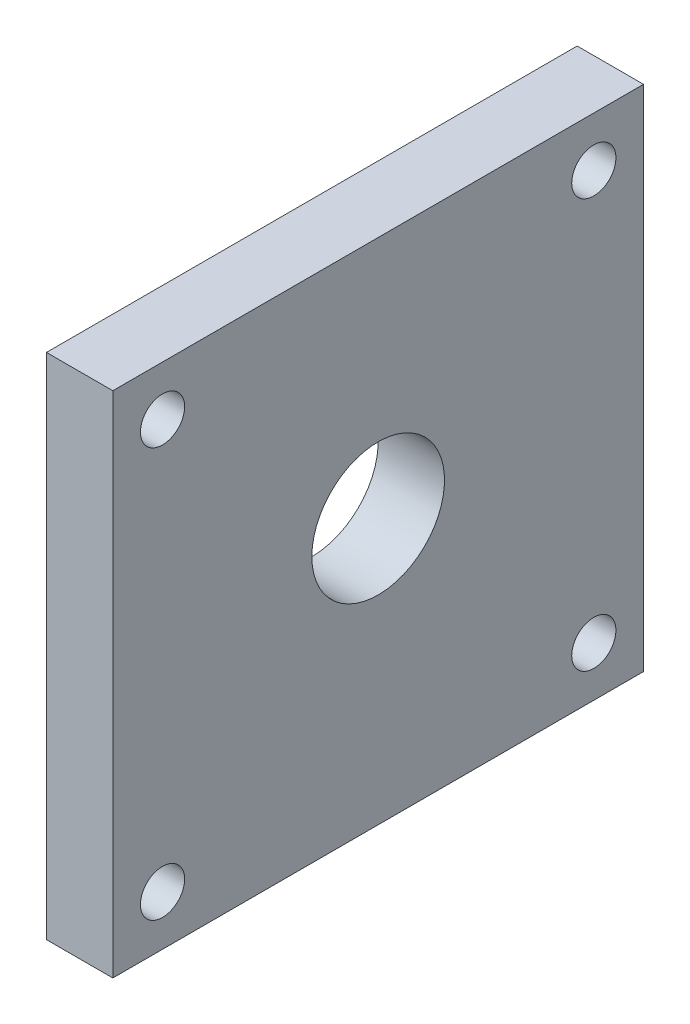
ISO-10303-21;
HEADER;
FILE_DESCRIPTION(('STEP AP214'),'2;1');
FILE_NAME('part.step','',(''),(''),'','','');
FILE_SCHEMA(('AUTOMOTIVE_DESIGN { 1 0 10303 214 1 1 1 1 }'));
ENDSEC;
DATA;
#1=APPLICATION_CONTEXT('core data for automotive mechanical design processes');
#2=APPLICATION_PROTOCOL_DEFINITION('international standard','automotive_design',2000,#1);
#3=PRODUCT_CONTEXT('',#1,'mechanical');
#4=PRODUCT('Part','Part','',(#3));
#5=PRODUCT_RELATED_PRODUCT_CATEGORY('part','',(#4));
#6=PRODUCT_DEFINITION_FORMATION('','',#4);
#7=PRODUCT_DEFINITION_CONTEXT('part definition',#1,'design');
#8=PRODUCT_DEFINITION('design','',#6,#7);
#9=PRODUCT_DEFINITION_SHAPE('','',#8);
#10=(LENGTH_UNIT() NAMED_UNIT(*) SI_UNIT(.MILLI.,.METRE.));
#11=(NAMED_UNIT(*) PLANE_ANGLE_UNIT() SI_UNIT($,.RADIAN.));
#12=(NAMED_UNIT(*) SI_UNIT($,.STERADIAN.) SOLID_ANGLE_UNIT());
#13=UNCERTAINTY_MEASURE_WITH_UNIT(LENGTH_MEASURE(1.E-05),#10,'distance_accuracy_value','');
#14=(GEOMETRIC_REPRESENTATION_CONTEXT(3) GLOBAL_UNCERTAINTY_ASSIGNED_CONTEXT((#13)) GLOBAL_UNIT_ASSIGNED_CONTEXT((#10,
#11,#12)) REPRESENTATION_CONTEXT('',''));
#15=CARTESIAN_POINT('',(0.,0.,0.));
#16=DIRECTION('',(0.,0.,1.));
#17=DIRECTION('',(1.,0.,0.));
#18=AXIS2_PLACEMENT_3D('',#15,#16,#17);
#19=CARTESIAN_POINT('',(9.525,0.,0.));
#20=DIRECTION('',(0.,0.,-1.));
#21=DIRECTION('',(0.,1.,0.));
#22=AXIS2_PLACEMENT_3D('',#19,#20,#21);
#23=PLANE('',#22);
#24=DIRECTION('',(0.,-1.,0.));
#25=VECTOR('',#24,1.);
#26=CARTESIAN_POINT('',(0.,0.,0.));
#27=LINE('',#26,#25);
#28=CARTESIAN_POINT('',(0.,0.,0.));
#29=VERTEX_POINT('',#28);
#30=CARTESIAN_POINT('',(0.,-73.025,0.));
#31=VERTEX_POINT('',#30);
#32=EDGE_CURVE('E76',#29,#31,#27,.T.);
#33=ORIENTED_EDGE('',*,*,#32,.T.);
#34=DIRECTION('',(-1.,0.,0.));
#35=VECTOR('',#34,1.);
#36=CARTESIAN_POINT('',(9.525,-73.025,0.));
#37=LINE('',#36,#35);
#38=CARTESIAN_POINT('',(9.525,-73.025,0.));
#39=VERTEX_POINT('',#38);
#40=EDGE_CURVE('E11',#39,#31,#37,.T.);
#41=ORIENTED_EDGE('',*,*,#40,.F.);
#42=DIRECTION('',(0.,-1.,0.));
#43=VECTOR('',#42,1.);
#44=CARTESIAN_POINT('',(9.525,0.,0.));
#45=LINE('',#44,#43);
#46=CARTESIAN_POINT('',(9.525,0.,0.));
#47=VERTEX_POINT('',#46);
#48=EDGE_CURVE('E99',#47,#39,#45,.T.);
#49=ORIENTED_EDGE('',*,*,#48,.F.);
#50=DIRECTION('',(-1.,0.,0.));
#51=VECTOR('',#50,1.);
#52=CARTESIAN_POINT('',(9.525,0.,0.));
#53=LINE('',#52,#51);
#54=EDGE_CURVE('E88',#47,#29,#53,.T.);
#55=ORIENTED_EDGE('',*,*,#54,.T.);
#56=EDGE_LOOP('',(#33,#41,#49,#55));
#57=FACE_BOUND('',#56,.T.);
#58=ADVANCED_FACE('F32',(#57),#23,.F.);
#59=CARTESIAN_POINT('',(9.525,-73.025,0.));
#60=DIRECTION('',(0.,1.,0.));
#61=DIRECTION('',(0.,0.,1.));
#62=AXIS2_PLACEMENT_3D('',#59,#60,#61);
#63=PLANE('',#62);
#64=DIRECTION('',(0.,0.,-1.));
#65=VECTOR('',#64,1.);
#66=CARTESIAN_POINT('',(0.,-73.025,0.));
#67=LINE('',#66,#65);
#68=CARTESIAN_POINT('',(0.,-73.025,-76.2));
#69=VERTEX_POINT('',#68);
#70=EDGE_CURVE('E72',#31,#69,#67,.T.);
#71=ORIENTED_EDGE('',*,*,#70,.T.);
#72=DIRECTION('',(-1.,0.,0.));
#73=VECTOR('',#72,1.);
#74=CARTESIAN_POINT('',(9.525,-73.025,-76.2));
#75=LINE('',#74,#73);
#76=CARTESIAN_POINT('',(9.525,-73.025,-76.2));
#77=VERTEX_POINT('',#76);
#78=EDGE_CURVE('E39',#77,#69,#75,.T.);
#79=ORIENTED_EDGE('',*,*,#78,.F.);
#80=DIRECTION('',(0.,0.,-1.));
#81=VECTOR('',#80,1.);
#82=CARTESIAN_POINT('',(9.525,-73.025,0.));
#83=LINE('',#82,#81);
#84=EDGE_CURVE('E84',#39,#77,#83,.T.);
#85=ORIENTED_EDGE('',*,*,#84,.F.);
#86=ORIENTED_EDGE('',*,*,#40,.T.);
#87=EDGE_LOOP('',(#71,#79,#85,#86));
#88=FACE_BOUND('',#87,.T.);
#89=ADVANCED_FACE('F83',(#88),#63,.F.);
#90=CARTESIAN_POINT('',(9.525,0.,-76.2));
#91=DIRECTION('',(0.,0.,1.));
#92=DIRECTION('',(0.,-1.,0.));
#93=AXIS2_PLACEMENT_3D('',#90,#91,#92);
#94=PLANE('',#93);
#95=DIRECTION('',(0.,1.,0.));
#96=VECTOR('',#95,1.);
#97=CARTESIAN_POINT('',(0.,0.,-76.2));
#98=LINE('',#97,#96);
#99=CARTESIAN_POINT('',(0.,0.,-76.2));
#100=VERTEX_POINT('',#99);
#101=EDGE_CURVE('E77',#69,#100,#98,.T.);
#102=ORIENTED_EDGE('',*,*,#101,.T.);
#103=DIRECTION('',(-1.,0.,0.));
#104=VECTOR('',#103,1.);
#105=CARTESIAN_POINT('',(9.525,0.,-76.2));
#106=LINE('',#105,#104);
#107=CARTESIAN_POINT('',(9.525,0.,-76.2));
#108=VERTEX_POINT('',#107);
#109=EDGE_CURVE('E105',#108,#100,#106,.T.);
#110=ORIENTED_EDGE('',*,*,#109,.F.);
#111=DIRECTION('',(0.,1.,0.));
#112=VECTOR('',#111,1.);
#113=CARTESIAN_POINT('',(9.525,0.,-76.2));
#114=LINE('',#113,#112);
#115=EDGE_CURVE('E51',#77,#108,#114,.T.);
#116=ORIENTED_EDGE('',*,*,#115,.F.);
#117=ORIENTED_EDGE('',*,*,#78,.T.);
#118=EDGE_LOOP('',(#102,#110,#116,#117));
#119=FACE_BOUND('',#118,.T.);
#120=ADVANCED_FACE('F108',(#119),#94,.F.);
#121=CARTESIAN_POINT('',(9.525,0.,0.));
#122=DIRECTION('',(0.,-1.,0.));
#123=DIRECTION('',(0.,0.,-1.));
#124=AXIS2_PLACEMENT_3D('',#121,#122,#123);
#125=PLANE('',#124);
#126=DIRECTION('',(0.,0.,1.));
#127=VECTOR('',#126,1.);
#128=CARTESIAN_POINT('',(0.,0.,0.));
#129=LINE('',#128,#127);
#130=EDGE_CURVE('E97',#100,#29,#129,.T.);
#131=ORIENTED_EDGE('',*,*,#130,.T.);
#132=ORIENTED_EDGE('',*,*,#54,.F.);
#133=DIRECTION('',(0.,0.,1.));
#134=VECTOR('',#133,1.);
#135=CARTESIAN_POINT('',(9.525,0.,0.));
#136=LINE('',#135,#134);
#137=EDGE_CURVE('E46',#108,#47,#136,.T.);
#138=ORIENTED_EDGE('',*,*,#137,.F.);
#139=ORIENTED_EDGE('',*,*,#109,.T.);
#140=EDGE_LOOP('',(#131,#132,#138,#139));
#141=FACE_BOUND('',#140,.T.);
#142=ADVANCED_FACE('F110',(#141),#125,.F.);
#143=CARTESIAN_POINT('',(9.525,-73.025,0.));
#144=DIRECTION('',(1.,0.,0.));
#145=DIRECTION('',(0.,0.,-1.));
#146=AXIS2_PLACEMENT_3D('',#143,#144,#145);
#147=PLANE('',#146);
#148=CARTESIAN_POINT('',(9.525,-34.925,-38.1));
#149=DIRECTION('',(-1.,0.,0.));
#150=DIRECTION('',(0.,0.,1.));
#151=AXIS2_PLACEMENT_3D('',#148,#149,#150);
#152=CIRCLE('',#151,9.525);
#153=CARTESIAN_POINT('',(9.525,-34.925,-28.575));
#154=VERTEX_POINT('',#153);
#155=EDGE_CURVE('E204',#154,#154,#152,.T.);
#156=ORIENTED_EDGE('',*,*,#155,.T.);
#157=EDGE_LOOP('',(#156));
#158=FACE_BOUND('',#157,.T.);
#159=CARTESIAN_POINT('',(9.525,-65.8876,-7.13740000000006));
#160=DIRECTION('',(-1.,0.,0.));
#161=DIRECTION('',(0.,0.,1.));
#162=AXIS2_PLACEMENT_3D('',#159,#160,#161);
#163=CIRCLE('',#162,3.175);
#164=CARTESIAN_POINT('',(9.525,-65.8876,-3.96240000000006));
#165=VERTEX_POINT('',#164);
#166=EDGE_CURVE('E214',#165,#165,#163,.T.);
#167=ORIENTED_EDGE('',*,*,#166,.T.);
#168=EDGE_LOOP('',(#167));
#169=FACE_BOUND('',#168,.T.);
#170=CARTESIAN_POINT('',(9.525,-65.8876,-69.0626));
#171=DIRECTION('',(-1.,0.,0.));
#172=DIRECTION('',(0.,0.,1.));
#173=AXIS2_PLACEMENT_3D('',#170,#171,#172);
#174=CIRCLE('',#173,3.175);
#175=CARTESIAN_POINT('',(9.525,-65.8876,-65.8876));
#176=VERTEX_POINT('',#175);
#177=EDGE_CURVE('E220',#176,#176,#174,.T.);
#178=ORIENTED_EDGE('',*,*,#177,.T.);
#179=EDGE_LOOP('',(#178));
#180=FACE_BOUND('',#179,.T.);
#181=CARTESIAN_POINT('',(9.525,-7.1374,-69.0626));
#182=DIRECTION('',(-1.,0.,0.));
#183=DIRECTION('',(0.,0.,1.));
#184=AXIS2_PLACEMENT_3D('',#181,#182,#183);
#185=CIRCLE('',#184,3.175);
#186=CARTESIAN_POINT('',(9.525,-7.1374,-65.8876));
#187=VERTEX_POINT('',#186);
#188=EDGE_CURVE('E226',#187,#187,#185,.T.);
#189=ORIENTED_EDGE('',*,*,#188,.T.);
#190=EDGE_LOOP('',(#189));
#191=FACE_BOUND('',#190,.T.);
#192=CARTESIAN_POINT('',(9.525,-7.1374,-7.13740000000003));
#193=DIRECTION('',(-1.,0.,0.));
#194=DIRECTION('',(0.,0.,1.));
#195=AXIS2_PLACEMENT_3D('',#192,#193,#194);
#196=CIRCLE('',#195,3.175);
#197=CARTESIAN_POINT('',(9.525,-7.1374,-3.96240000000003));
#198=VERTEX_POINT('',#197);
#199=EDGE_CURVE('E89',#198,#198,#196,.T.);
#200=ORIENTED_EDGE('',*,*,#199,.T.);
#201=EDGE_LOOP('',(#200));
#202=FACE_BOUND('',#201,.T.);
#203=ORIENTED_EDGE('',*,*,#48,.T.);
#204=ORIENTED_EDGE('',*,*,#84,.T.);
#205=ORIENTED_EDGE('',*,*,#115,.T.);
#206=ORIENTED_EDGE('',*,*,#137,.T.);
#207=EDGE_LOOP('',(#203,#204,#205,#206));
#208=FACE_BOUND('',#207,.T.);
#209=ADVANCED_FACE('F111',(#158,#169,#180,#191,#202,#208),#147,.T.);
#210=CARTESIAN_POINT('',(0.,-73.025,0.));
#211=DIRECTION('',(1.,0.,0.));
#212=DIRECTION('',(0.,0.,-1.));
#213=AXIS2_PLACEMENT_3D('',#210,#211,#212);
#214=PLANE('',#213);
#215=CARTESIAN_POINT('',(0.,-34.925,-38.1));
#216=DIRECTION('',(-1.,0.,0.));
#217=DIRECTION('',(0.,0.,1.));
#218=AXIS2_PLACEMENT_3D('',#215,#216,#217);
#219=CIRCLE('',#218,9.525);
#220=CARTESIAN_POINT('',(0.,-34.925,-28.575));
#221=VERTEX_POINT('',#220);
#222=EDGE_CURVE('E207',#221,#221,#219,.T.);
#223=ORIENTED_EDGE('',*,*,#222,.F.);
#224=EDGE_LOOP('',(#223));
#225=FACE_BOUND('',#224,.T.);
#226=CARTESIAN_POINT('',(0.,-65.8876,-7.13740000000006));
#227=DIRECTION('',(-1.,0.,0.));
#228=DIRECTION('',(0.,0.,1.));
#229=AXIS2_PLACEMENT_3D('',#226,#227,#228);
#230=CIRCLE('',#229,3.175);
#231=CARTESIAN_POINT('',(0.,-65.8876,-3.96240000000006));
#232=VERTEX_POINT('',#231);
#233=EDGE_CURVE('E209',#232,#232,#230,.T.);
#234=ORIENTED_EDGE('',*,*,#233,.F.);
#235=EDGE_LOOP('',(#234));
#236=FACE_BOUND('',#235,.T.);
#237=CARTESIAN_POINT('',(0.,-65.8876,-69.0626));
#238=DIRECTION('',(-1.,0.,0.));
#239=DIRECTION('',(0.,0.,1.));
#240=AXIS2_PLACEMENT_3D('',#237,#238,#239);
#241=CIRCLE('',#240,3.175);
#242=CARTESIAN_POINT('',(0.,-65.8876,-65.8876));
#243=VERTEX_POINT('',#242);
#244=EDGE_CURVE('E217',#243,#243,#241,.T.);
#245=ORIENTED_EDGE('',*,*,#244,.F.);
#246=EDGE_LOOP('',(#245));
#247=FACE_BOUND('',#246,.T.);
#248=CARTESIAN_POINT('',(0.,-7.1374,-69.0626));
#249=DIRECTION('',(-1.,0.,0.));
#250=DIRECTION('',(0.,0.,1.));
#251=AXIS2_PLACEMENT_3D('',#248,#249,#250);
#252=CIRCLE('',#251,3.175);
#253=CARTESIAN_POINT('',(0.,-7.1374,-65.8876));
#254=VERTEX_POINT('',#253);
#255=EDGE_CURVE('E223',#254,#254,#252,.T.);
#256=ORIENTED_EDGE('',*,*,#255,.F.);
#257=EDGE_LOOP('',(#256));
#258=FACE_BOUND('',#257,.T.);
#259=CARTESIAN_POINT('',(0.,-7.1374,-7.13740000000003));
#260=DIRECTION('',(-1.,0.,0.));
#261=DIRECTION('',(0.,0.,1.));
#262=AXIS2_PLACEMENT_3D('',#259,#260,#261);
#263=CIRCLE('',#262,3.175);
#264=CARTESIAN_POINT('',(0.,-7.1374,-3.96240000000003));
#265=VERTEX_POINT('',#264);
#266=EDGE_CURVE('E92',#265,#265,#263,.T.);
#267=ORIENTED_EDGE('',*,*,#266,.F.);
#268=EDGE_LOOP('',(#267));
#269=FACE_BOUND('',#268,.T.);
#270=ORIENTED_EDGE('',*,*,#32,.F.);
#271=ORIENTED_EDGE('',*,*,#130,.F.);
#272=ORIENTED_EDGE('',*,*,#101,.F.);
#273=ORIENTED_EDGE('',*,*,#70,.F.);
#274=EDGE_LOOP('',(#270,#271,#272,#273));
#275=FACE_BOUND('',#274,.T.);
#276=ADVANCED_FACE('F73',(#225,#236,#247,#258,#269,#275),#214,.F.);
#277=CARTESIAN_POINT('',(9.525,-7.1374,-7.13740000000003));
#278=DIRECTION('',(-1.,0.,0.));
#279=DIRECTION('',(0.,0.,1.));
#280=AXIS2_PLACEMENT_3D('',#277,#278,#279);
#281=CYLINDRICAL_SURFACE('',#280,3.175);
#282=ORIENTED_EDGE('',*,*,#199,.F.);
#283=EDGE_LOOP('',(#282));
#284=FACE_BOUND('',#283,.T.);
#285=ORIENTED_EDGE('',*,*,#266,.T.);
#286=EDGE_LOOP('',(#285));
#287=FACE_BOUND('',#286,.T.);
#288=ADVANCED_FACE('F119',(#284,#287),#281,.F.);
#289=CARTESIAN_POINT('',(9.525,-7.1374,-69.0626));
#290=DIRECTION('',(-1.,0.,0.));
#291=DIRECTION('',(0.,0.,1.));
#292=AXIS2_PLACEMENT_3D('',#289,#290,#291);
#293=CYLINDRICAL_SURFACE('',#292,3.175);
#294=ORIENTED_EDGE('',*,*,#188,.F.);
#295=EDGE_LOOP('',(#294));
#296=FACE_BOUND('',#295,.T.);
#297=ORIENTED_EDGE('',*,*,#255,.T.);
#298=EDGE_LOOP('',(#297));
#299=FACE_BOUND('',#298,.T.);
#300=ADVANCED_FACE('F158',(#296,#299),#293,.F.);
#301=CARTESIAN_POINT('',(9.525,-65.8876,-69.0626));
#302=DIRECTION('',(-1.,0.,0.));
#303=DIRECTION('',(0.,0.,1.));
#304=AXIS2_PLACEMENT_3D('',#301,#302,#303);
#305=CYLINDRICAL_SURFACE('',#304,3.175);
#306=ORIENTED_EDGE('',*,*,#177,.F.);
#307=EDGE_LOOP('',(#306));
#308=FACE_BOUND('',#307,.T.);
#309=ORIENTED_EDGE('',*,*,#244,.T.);
#310=EDGE_LOOP('',(#309));
#311=FACE_BOUND('',#310,.T.);
#312=ADVANCED_FACE('F168',(#308,#311),#305,.F.);
#313=CARTESIAN_POINT('',(9.525,-65.8876,-7.13740000000006));
#314=DIRECTION('',(-1.,0.,0.));
#315=DIRECTION('',(0.,0.,1.));
#316=AXIS2_PLACEMENT_3D('',#313,#314,#315);
#317=CYLINDRICAL_SURFACE('',#316,3.175);
#318=ORIENTED_EDGE('',*,*,#166,.F.);
#319=EDGE_LOOP('',(#318));
#320=FACE_BOUND('',#319,.T.);
#321=ORIENTED_EDGE('',*,*,#233,.T.);
#322=EDGE_LOOP('',(#321));
#323=FACE_BOUND('',#322,.T.);
#324=ADVANCED_FACE('F178',(#320,#323),#317,.F.);
#325=CARTESIAN_POINT('',(9.525,-34.925,-38.1));
#326=DIRECTION('',(-1.,0.,0.));
#327=DIRECTION('',(0.,0.,1.));
#328=AXIS2_PLACEMENT_3D('',#325,#326,#327);
#329=CYLINDRICAL_SURFACE('',#328,9.525);
#330=ORIENTED_EDGE('',*,*,#155,.F.);
#331=EDGE_LOOP('',(#330));
#332=FACE_BOUND('',#331,.T.);
#333=ORIENTED_EDGE('',*,*,#222,.T.);
#334=EDGE_LOOP('',(#333));
#335=FACE_BOUND('',#334,.T.);
#336=ADVANCED_FACE('F188',(#332,#335),#329,.F.);
#337=CLOSED_SHELL('',(#58,#89,#120,#142,#209,#276,#288,#300,#312,#324,#336));
#338=MANIFOLD_SOLID_BREP('B2',#337);
#339=ADVANCED_BREP_SHAPE_REPRESENTATION('',(#18,#338),#14);
#340=SHAPE_DEFINITION_REPRESENTATION(#9,#339);
ENDSEC;
END-ISO-10303-21;
